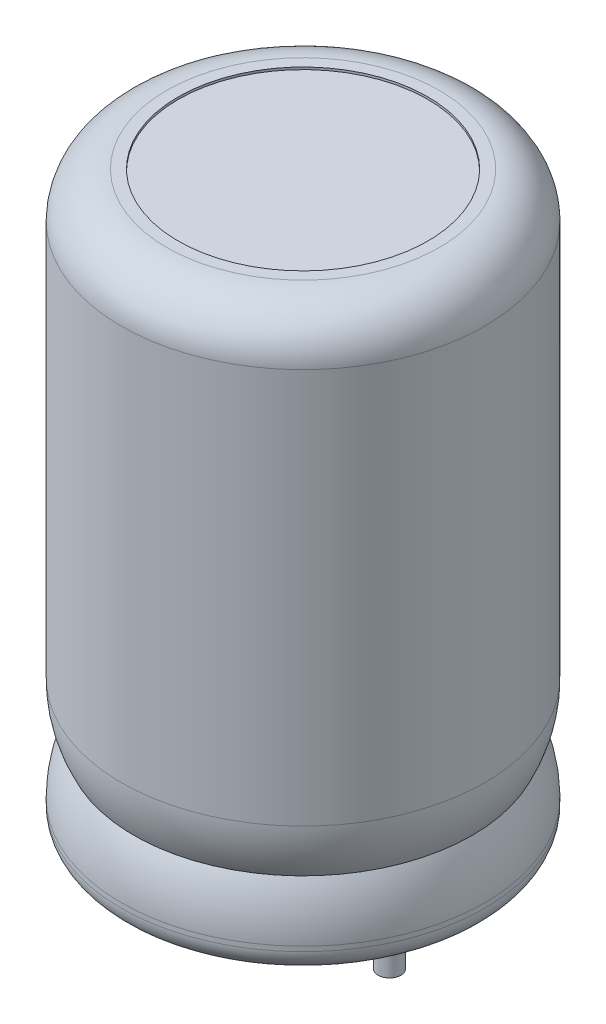
ISO-10303-21;
HEADER;
FILE_DESCRIPTION(('STEP AP214'),'2;1');
FILE_NAME('part.step','',(''),(''),'','','');
FILE_SCHEMA(('AUTOMOTIVE_DESIGN { 1 0 10303 214 1 1 1 1 }'));
ENDSEC;
DATA;
#1=APPLICATION_CONTEXT('core data for automotive mechanical design processes');
#2=APPLICATION_PROTOCOL_DEFINITION('international standard','automotive_design',2000,#1);
#3=PRODUCT_CONTEXT('',#1,'mechanical');
#4=PRODUCT('Part','Part','',(#3));
#5=PRODUCT_RELATED_PRODUCT_CATEGORY('part','',(#4));
#6=PRODUCT_DEFINITION_FORMATION('','',#4);
#7=PRODUCT_DEFINITION_CONTEXT('part definition',#1,'design');
#8=PRODUCT_DEFINITION('design','',#6,#7);
#9=PRODUCT_DEFINITION_SHAPE('','',#8);
#10=(LENGTH_UNIT() NAMED_UNIT(*) SI_UNIT(.MILLI.,.METRE.));
#11=(NAMED_UNIT(*) PLANE_ANGLE_UNIT() SI_UNIT($,.RADIAN.));
#12=(NAMED_UNIT(*) SI_UNIT($,.STERADIAN.) SOLID_ANGLE_UNIT());
#13=UNCERTAINTY_MEASURE_WITH_UNIT(LENGTH_MEASURE(1.E-05),#10,'distance_accuracy_value','');
#14=(GEOMETRIC_REPRESENTATION_CONTEXT(3) GLOBAL_UNCERTAINTY_ASSIGNED_CONTEXT((#13)) GLOBAL_UNIT_ASSIGNED_CONTEXT((#10,
#11,#12)) REPRESENTATION_CONTEXT('',''));
#15=CARTESIAN_POINT('',(0.,0.,0.));
#16=DIRECTION('',(0.,0.,1.));
#17=DIRECTION('',(1.,0.,0.));
#18=AXIS2_PLACEMENT_3D('',#15,#16,#17);
#19=CARTESIAN_POINT('',(-3.81,0.0999999999999993,0.));
#20=DIRECTION('',(0.,1.,0.));
#21=DIRECTION('',(-1.,0.,0.));
#22=AXIS2_PLACEMENT_3D('',#19,#20,#21);
#23=PLANE('',#22);
#24=CARTESIAN_POINT('',(0.,0.0999999999999998,0.));
#25=DIRECTION('',(0.,1.,0.));
#26=DIRECTION('',(-1.,0.,0.));
#27=AXIS2_PLACEMENT_3D('',#24,#25,#26);
#28=CIRCLE('',#27,0.5);
#29=CARTESIAN_POINT('',(-0.5,0.0999999999999998,0.));
#30=VERTEX_POINT('',#29);
#31=EDGE_CURVE('E38',#30,#30,#28,.F.);
#32=ORIENTED_EDGE('',*,*,#31,.F.);
#33=EDGE_LOOP('',(#32));
#34=FACE_BOUND('',#33,.T.);
#35=CARTESIAN_POINT('',(-3.81,0.0999999999999994,0.));
#36=DIRECTION('',(0.,1.,0.));
#37=DIRECTION('',(-1.,0.,0.));
#38=AXIS2_PLACEMENT_3D('',#35,#36,#37);
#39=CIRCLE('',#38,5.5);
#40=CARTESIAN_POINT('',(-9.31,0.0999999999999986,0.));
#41=VERTEX_POINT('',#40);
#42=EDGE_CURVE('E75',#41,#41,#39,.T.);
#43=ORIENTED_EDGE('',*,*,#42,.F.);
#44=EDGE_LOOP('',(#43));
#45=FACE_BOUND('',#44,.T.);
#46=CARTESIAN_POINT('',(-7.62,0.099999999999999,0.));
#47=DIRECTION('',(0.,1.,0.));
#48=DIRECTION('',(-1.,0.,0.));
#49=AXIS2_PLACEMENT_3D('',#46,#47,#48);
#50=CIRCLE('',#49,0.5);
#51=CARTESIAN_POINT('',(-8.12,0.0999999999999989,0.));
#52=VERTEX_POINT('',#51);
#53=EDGE_CURVE('E10',#52,#52,#50,.F.);
#54=ORIENTED_EDGE('',*,*,#53,.F.);
#55=EDGE_LOOP('',(#54));
#56=FACE_BOUND('',#55,.T.);
#57=ADVANCED_FACE('F31',(#34,#45,#56),#23,.F.);
#58=CARTESIAN_POINT('',(-3.81000000000001,25.1,0.));
#59=DIRECTION('',(0.,-1.,0.));
#60=DIRECTION('',(1.,0.,0.));
#61=AXIS2_PLACEMENT_3D('',#58,#59,#60);
#62=PLANE('',#61);
#63=CARTESIAN_POINT('',(-3.81000000000001,25.1,0.));
#64=DIRECTION('',(0.,1.,0.));
#65=DIRECTION('',(-1.,0.,0.));
#66=AXIS2_PLACEMENT_3D('',#63,#64,#65);
#67=CIRCLE('',#66,5.5);
#68=CARTESIAN_POINT('',(-9.31,25.1,0.));
#69=VERTEX_POINT('',#68);
#70=EDGE_CURVE('E42',#69,#69,#67,.T.);
#71=ORIENTED_EDGE('',*,*,#70,.T.);
#72=EDGE_LOOP('',(#71));
#73=FACE_BOUND('',#72,.T.);
#74=ADVANCED_FACE('F33',(#73),#62,.F.);
#75=CARTESIAN_POINT('',(-3.81000000000001,25.2,0.));
#76=DIRECTION('',(0.,1.,0.));
#77=DIRECTION('',(-1.,0.,0.));
#78=AXIS2_PLACEMENT_3D('',#75,#76,#77);
#79=CYLINDRICAL_SURFACE('',#78,5.5);
#80=ORIENTED_EDGE('',*,*,#70,.F.);
#81=EDGE_LOOP('',(#80));
#82=FACE_BOUND('',#81,.T.);
#83=CARTESIAN_POINT('',(-3.81000000000001,25.2,0.));
#84=DIRECTION('',(0.,1.,0.));
#85=DIRECTION('',(-1.,0.,0.));
#86=AXIS2_PLACEMENT_3D('',#83,#84,#85);
#87=CIRCLE('',#86,5.5);
#88=CARTESIAN_POINT('',(-9.31,25.2,0.));
#89=VERTEX_POINT('',#88);
#90=EDGE_CURVE('E46',#89,#89,#87,.T.);
#91=ORIENTED_EDGE('',*,*,#90,.T.);
#92=EDGE_LOOP('',(#91));
#93=FACE_BOUND('',#92,.T.);
#94=ADVANCED_FACE('F105',(#82,#93),#79,.F.);
#95=CARTESIAN_POINT('',(1.68999999999999,25.2,0.));
#96=DIRECTION('',(0.,-1.,0.));
#97=DIRECTION('',(1.,0.,0.));
#98=AXIS2_PLACEMENT_3D('',#95,#96,#97);
#99=PLANE('',#98);
#100=ORIENTED_EDGE('',*,*,#90,.F.);
#101=EDGE_LOOP('',(#100));
#102=FACE_BOUND('',#101,.T.);
#103=CARTESIAN_POINT('',(-3.81000000000001,25.2,0.));
#104=DIRECTION('',(0.,1.,0.));
#105=DIRECTION('',(-1.,0.,0.));
#106=AXIS2_PLACEMENT_3D('',#103,#104,#105);
#107=CIRCLE('',#106,6.);
#108=CARTESIAN_POINT('',(-9.81000000000001,25.2,0.));
#109=VERTEX_POINT('',#108);
#110=EDGE_CURVE('E51',#109,#109,#107,.T.);
#111=ORIENTED_EDGE('',*,*,#110,.T.);
#112=EDGE_LOOP('',(#111));
#113=FACE_BOUND('',#112,.T.);
#114=ADVANCED_FACE('F141',(#102,#113),#99,.F.);
#115=CARTESIAN_POINT('',(-3.81000000000001,23.2,0.));
#116=DIRECTION('',(0.,1.,0.));
#117=DIRECTION('',(-1.,0.,0.));
#118=AXIS2_PLACEMENT_3D('',#115,#116,#117);
#119=TOROIDAL_SURFACE('',#118,6.,2.);
#120=ORIENTED_EDGE('',*,*,#110,.F.);
#121=EDGE_LOOP('',(#120));
#122=FACE_BOUND('',#121,.T.);
#123=CARTESIAN_POINT('',(-3.81,23.2,0.));
#124=DIRECTION('',(0.,1.,0.));
#125=DIRECTION('',(-1.,0.,0.));
#126=AXIS2_PLACEMENT_3D('',#123,#124,#125);
#127=CIRCLE('',#126,8.);
#128=CARTESIAN_POINT('',(-11.81,23.2,0.));
#129=VERTEX_POINT('',#128);
#130=EDGE_CURVE('E54',#129,#129,#127,.T.);
#131=ORIENTED_EDGE('',*,*,#130,.T.);
#132=EDGE_LOOP('',(#131));
#133=FACE_BOUND('',#132,.T.);
#134=ADVANCED_FACE('F137',(#122,#133),#119,.T.);
#135=CARTESIAN_POINT('',(-3.81000000000001,25.2,0.));
#136=DIRECTION('',(0.,1.,0.));
#137=DIRECTION('',(-1.,0.,0.));
#138=AXIS2_PLACEMENT_3D('',#135,#136,#137);
#139=CYLINDRICAL_SURFACE('',#138,8.);
#140=ORIENTED_EDGE('',*,*,#130,.F.);
#141=EDGE_LOOP('',(#140));
#142=FACE_BOUND('',#141,.T.);
#143=CARTESIAN_POINT('',(-3.81,5.79,0.));
#144=DIRECTION('',(0.,1.,0.));
#145=DIRECTION('',(-1.,0.,0.));
#146=AXIS2_PLACEMENT_3D('',#143,#144,#145);
#147=CIRCLE('',#146,8.);
#148=CARTESIAN_POINT('',(-11.81,5.79,0.));
#149=VERTEX_POINT('',#148);
#150=EDGE_CURVE('E57',#149,#149,#147,.T.);
#151=ORIENTED_EDGE('',*,*,#150,.T.);
#152=EDGE_LOOP('',(#151));
#153=FACE_BOUND('',#152,.T.);
#154=ADVANCED_FACE('F133',(#142,#153),#139,.T.);
#155=CARTESIAN_POINT('',(-3.81,5.79,0.));
#156=DIRECTION('',(0.,1.,0.));
#157=DIRECTION('',(-1.,0.,0.));
#158=AXIS2_PLACEMENT_3D('',#155,#156,#157);
#159=DEGENERATE_TOROIDAL_SURFACE('',#158,3.,5.,.T.);
#160=ORIENTED_EDGE('',*,*,#150,.F.);
#161=EDGE_LOOP('',(#160));
#162=FACE_BOUND('',#161,.T.);
#163=CARTESIAN_POINT('',(-3.81,3.5,0.));
#164=DIRECTION('',(0.,1.,0.));
#165=DIRECTION('',(-1.,0.,0.));
#166=AXIS2_PLACEMENT_3D('',#163,#164,#165);
#167=CIRCLE('',#166,7.44476096095167);
#168=CARTESIAN_POINT('',(-11.2547609609517,3.5,0.));
#169=VERTEX_POINT('',#168);
#170=EDGE_CURVE('E60',#169,#169,#167,.T.);
#171=ORIENTED_EDGE('',*,*,#170,.T.);
#172=EDGE_LOOP('',(#171));
#173=FACE_BOUND('',#172,.T.);
#174=ADVANCED_FACE('F129',(#162,#173),#159,.T.);
#175=CARTESIAN_POINT('',(-3.81,1.21,0.));
#176=DIRECTION('',(0.,1.,0.));
#177=DIRECTION('',(-1.,0.,0.));
#178=AXIS2_PLACEMENT_3D('',#175,#176,#177);
#179=DEGENERATE_TOROIDAL_SURFACE('',#178,3.,5.,.T.);
#180=ORIENTED_EDGE('',*,*,#170,.F.);
#181=EDGE_LOOP('',(#180));
#182=FACE_BOUND('',#181,.T.);
#183=CARTESIAN_POINT('',(-3.81,1.21,0.));
#184=DIRECTION('',(0.,1.,0.));
#185=DIRECTION('',(-1.,0.,0.));
#186=AXIS2_PLACEMENT_3D('',#183,#184,#185);
#187=CIRCLE('',#186,8.);
#188=CARTESIAN_POINT('',(-11.81,1.21,0.));
#189=VERTEX_POINT('',#188);
#190=EDGE_CURVE('E63',#189,#189,#187,.T.);
#191=ORIENTED_EDGE('',*,*,#190,.T.);
#192=EDGE_LOOP('',(#191));
#193=FACE_BOUND('',#192,.T.);
#194=ADVANCED_FACE('F125',(#182,#193),#179,.T.);
#195=CARTESIAN_POINT('',(-3.81000000000001,25.2,0.));
#196=DIRECTION('',(0.,1.,0.));
#197=DIRECTION('',(-1.,0.,0.));
#198=AXIS2_PLACEMENT_3D('',#195,#196,#197);
#199=CYLINDRICAL_SURFACE('',#198,8.);
#200=ORIENTED_EDGE('',*,*,#190,.F.);
#201=EDGE_LOOP('',(#200));
#202=FACE_BOUND('',#201,.T.);
#203=CARTESIAN_POINT('',(-3.81,1.,0.));
#204=DIRECTION('',(0.,1.,0.));
#205=DIRECTION('',(-1.,0.,0.));
#206=AXIS2_PLACEMENT_3D('',#203,#204,#205);
#207=CIRCLE('',#206,8.);
#208=CARTESIAN_POINT('',(-11.81,1.,0.));
#209=VERTEX_POINT('',#208);
#210=EDGE_CURVE('E66',#209,#209,#207,.T.);
#211=ORIENTED_EDGE('',*,*,#210,.T.);
#212=EDGE_LOOP('',(#211));
#213=FACE_BOUND('',#212,.T.);
#214=ADVANCED_FACE('F121',(#202,#213),#199,.T.);
#215=CARTESIAN_POINT('',(-3.81,1.,0.));
#216=DIRECTION('',(0.,1.,0.));
#217=DIRECTION('',(-1.,0.,0.));
#218=AXIS2_PLACEMENT_3D('',#215,#216,#217);
#219=TOROIDAL_SURFACE('',#218,7.,1.);
#220=ORIENTED_EDGE('',*,*,#210,.F.);
#221=EDGE_LOOP('',(#220));
#222=FACE_BOUND('',#221,.T.);
#223=CARTESIAN_POINT('',(-3.81,0.,0.));
#224=DIRECTION('',(0.,1.,0.));
#225=DIRECTION('',(-1.,0.,0.));
#226=AXIS2_PLACEMENT_3D('',#223,#224,#225);
#227=CIRCLE('',#226,7.);
#228=CARTESIAN_POINT('',(-10.81,0.,0.));
#229=VERTEX_POINT('',#228);
#230=EDGE_CURVE('E69',#229,#229,#227,.T.);
#231=ORIENTED_EDGE('',*,*,#230,.T.);
#232=EDGE_LOOP('',(#231));
#233=FACE_BOUND('',#232,.T.);
#234=ADVANCED_FACE('F117',(#222,#233),#219,.T.);
#235=CARTESIAN_POINT('',(1.69,0.,0.));
#236=DIRECTION('',(0.,1.,0.));
#237=DIRECTION('',(-1.,0.,0.));
#238=AXIS2_PLACEMENT_3D('',#235,#236,#237);
#239=PLANE('',#238);
#240=ORIENTED_EDGE('',*,*,#230,.F.);
#241=EDGE_LOOP('',(#240));
#242=FACE_BOUND('',#241,.T.);
#243=CARTESIAN_POINT('',(-3.81,0.,0.));
#244=DIRECTION('',(0.,1.,0.));
#245=DIRECTION('',(-1.,0.,0.));
#246=AXIS2_PLACEMENT_3D('',#243,#244,#245);
#247=CIRCLE('',#246,5.5);
#248=CARTESIAN_POINT('',(-9.31,0.,0.));
#249=VERTEX_POINT('',#248);
#250=EDGE_CURVE('E72',#249,#249,#247,.T.);
#251=ORIENTED_EDGE('',*,*,#250,.T.);
#252=EDGE_LOOP('',(#251));
#253=FACE_BOUND('',#252,.T.);
#254=ADVANCED_FACE('F113',(#242,#253),#239,.F.);
#255=CARTESIAN_POINT('',(-3.81000000000001,25.2,0.));
#256=DIRECTION('',(0.,1.,0.));
#257=DIRECTION('',(-1.,0.,0.));
#258=AXIS2_PLACEMENT_3D('',#255,#256,#257);
#259=CYLINDRICAL_SURFACE('',#258,5.5);
#260=ORIENTED_EDGE('',*,*,#250,.F.);
#261=EDGE_LOOP('',(#260));
#262=FACE_BOUND('',#261,.T.);
#263=ORIENTED_EDGE('',*,*,#42,.T.);
#264=EDGE_LOOP('',(#263));
#265=FACE_BOUND('',#264,.T.);
#266=ADVANCED_FACE('F110',(#262,#265),#259,.F.);
#267=CARTESIAN_POINT('',(0.,-3.4,0.));
#268=DIRECTION('',(0.,1.,0.));
#269=DIRECTION('',(-1.,0.,0.));
#270=AXIS2_PLACEMENT_3D('',#267,#268,#269);
#271=CYLINDRICAL_SURFACE('',#270,0.5);
#272=CARTESIAN_POINT('',(0.,-3.4,0.));
#273=DIRECTION('',(0.,-1.,0.));
#274=DIRECTION('',(1.,0.,0.));
#275=AXIS2_PLACEMENT_3D('',#272,#273,#274);
#276=CIRCLE('',#275,0.5);
#277=CARTESIAN_POINT('',(0.5,-3.4,0.));
#278=VERTEX_POINT('',#277);
#279=EDGE_CURVE('E78',#278,#278,#276,.T.);
#280=ORIENTED_EDGE('',*,*,#279,.F.);
#281=EDGE_LOOP('',(#280));
#282=FACE_BOUND('',#281,.T.);
#283=ORIENTED_EDGE('',*,*,#31,.T.);
#284=EDGE_LOOP('',(#283));
#285=FACE_BOUND('',#284,.T.);
#286=ADVANCED_FACE('F96',(#282,#285),#271,.T.);
#287=CARTESIAN_POINT('',(0.,-3.4,0.));
#288=DIRECTION('',(0.,-1.,0.));
#289=DIRECTION('',(1.,0.,0.));
#290=AXIS2_PLACEMENT_3D('',#287,#288,#289);
#291=PLANE('',#290);
#292=ORIENTED_EDGE('',*,*,#279,.T.);
#293=EDGE_LOOP('',(#292));
#294=FACE_BOUND('',#293,.T.);
#295=ADVANCED_FACE('F89',(#294),#291,.T.);
#296=CARTESIAN_POINT('',(-7.62,-3.4,0.));
#297=DIRECTION('',(0.,1.,0.));
#298=DIRECTION('',(-1.,0.,0.));
#299=AXIS2_PLACEMENT_3D('',#296,#297,#298);
#300=CYLINDRICAL_SURFACE('',#299,0.5);
#301=CARTESIAN_POINT('',(-7.62,-3.4,0.));
#302=DIRECTION('',(0.,-1.,0.));
#303=DIRECTION('',(1.,0.,0.));
#304=AXIS2_PLACEMENT_3D('',#301,#302,#303);
#305=CIRCLE('',#304,0.5);
#306=CARTESIAN_POINT('',(-7.12,-3.4,0.));
#307=VERTEX_POINT('',#306);
#308=EDGE_CURVE('E81',#307,#307,#305,.T.);
#309=ORIENTED_EDGE('',*,*,#308,.F.);
#310=EDGE_LOOP('',(#309));
#311=FACE_BOUND('',#310,.T.);
#312=ORIENTED_EDGE('',*,*,#53,.T.);
#313=EDGE_LOOP('',(#312));
#314=FACE_BOUND('',#313,.T.);
#315=ADVANCED_FACE('F87',(#311,#314),#300,.T.);
#316=CARTESIAN_POINT('',(-7.62,-3.4,0.));
#317=DIRECTION('',(0.,-1.,0.));
#318=DIRECTION('',(1.,0.,0.));
#319=AXIS2_PLACEMENT_3D('',#316,#317,#318);
#320=PLANE('',#319);
#321=ORIENTED_EDGE('',*,*,#308,.T.);
#322=EDGE_LOOP('',(#321));
#323=FACE_BOUND('',#322,.T.);
#324=ADVANCED_FACE('F85',(#323),#320,.T.);
#325=CLOSED_SHELL('',(#57,#74,#94,#114,#134,#154,#174,#194,#214,#234,#254,#266,#286,#295,#315,#324));
#326=MANIFOLD_SOLID_BREP('B2',#325);
#327=ADVANCED_BREP_SHAPE_REPRESENTATION('',(#18,#326),#14);
#328=SHAPE_DEFINITION_REPRESENTATION(#9,#327);
ENDSEC;
END-ISO-10303-21;
